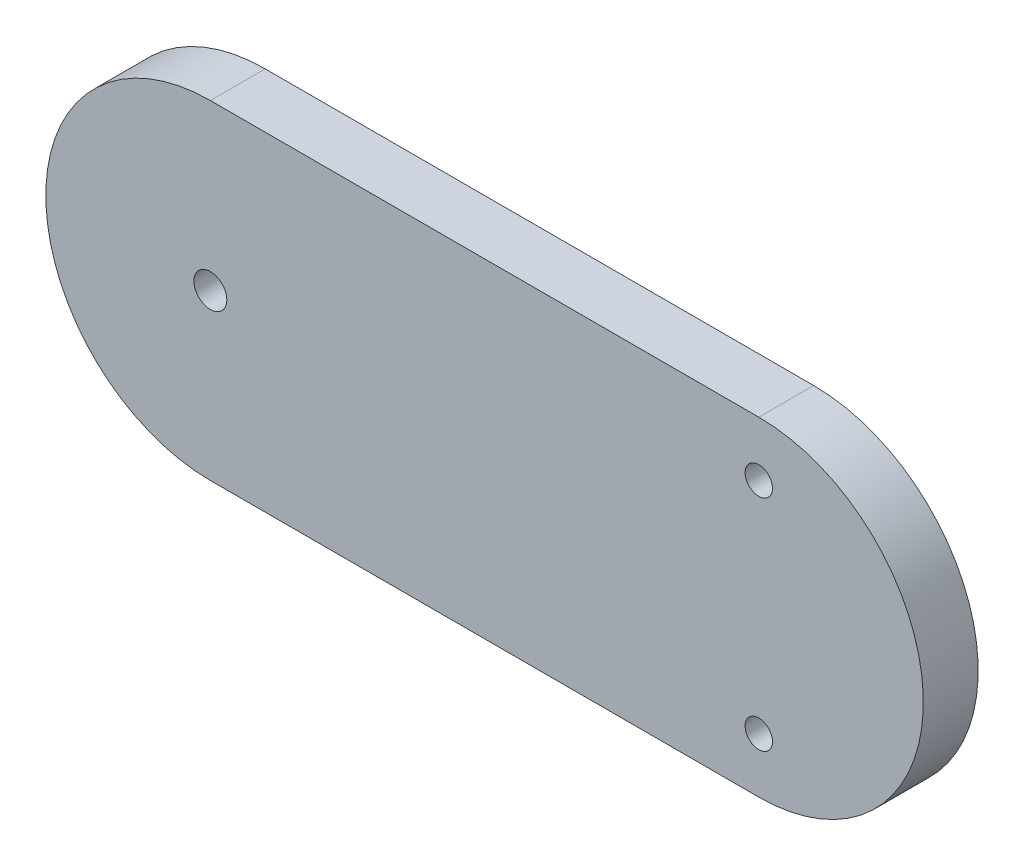
ISO-10303-21;
HEADER;
FILE_DESCRIPTION(('STEP AP214'),'2;1');
FILE_NAME('part.step','',(''),(''),'','','');
FILE_SCHEMA(('AUTOMOTIVE_DESIGN { 1 0 10303 214 1 1 1 1 }'));
ENDSEC;
DATA;
#1=APPLICATION_CONTEXT('core data for automotive mechanical design processes');
#2=APPLICATION_PROTOCOL_DEFINITION('international standard','automotive_design',2000,#1);
#3=PRODUCT_CONTEXT('',#1,'mechanical');
#4=PRODUCT('Part','Part','',(#3));
#5=PRODUCT_RELATED_PRODUCT_CATEGORY('part','',(#4));
#6=PRODUCT_DEFINITION_FORMATION('','',#4);
#7=PRODUCT_DEFINITION_CONTEXT('part definition',#1,'design');
#8=PRODUCT_DEFINITION('design','',#6,#7);
#9=PRODUCT_DEFINITION_SHAPE('','',#8);
#10=(LENGTH_UNIT() NAMED_UNIT(*) SI_UNIT(.MILLI.,.METRE.));
#11=(NAMED_UNIT(*) PLANE_ANGLE_UNIT() SI_UNIT($,.RADIAN.));
#12=(NAMED_UNIT(*) SI_UNIT($,.STERADIAN.) SOLID_ANGLE_UNIT());
#13=UNCERTAINTY_MEASURE_WITH_UNIT(LENGTH_MEASURE(1.E-05),#10,'distance_accuracy_value','');
#14=(GEOMETRIC_REPRESENTATION_CONTEXT(3) GLOBAL_UNCERTAINTY_ASSIGNED_CONTEXT((#13)) GLOBAL_UNIT_ASSIGNED_CONTEXT((#10,
#11,#12)) REPRESENTATION_CONTEXT('',''));
#15=CARTESIAN_POINT('',(0.,0.,0.));
#16=DIRECTION('',(0.,0.,1.));
#17=DIRECTION('',(1.,0.,0.));
#18=AXIS2_PLACEMENT_3D('',#15,#16,#17);
#19=CARTESIAN_POINT('',(-21.2273246696161,0.,5.));
#20=DIRECTION('',(0.,0.,1.));
#21=DIRECTION('',(1.,0.,0.));
#22=AXIS2_PLACEMENT_3D('',#19,#20,#21);
#23=PLANE('',#22);
#24=CARTESIAN_POINT('',(28.7726753303839,10.,5.));
#25=DIRECTION('',(0.,0.,1.));
#26=DIRECTION('',(1.,0.,0.));
#27=AXIS2_PLACEMENT_3D('',#24,#25,#26);
#28=CIRCLE('',#27,1.25);
#29=CARTESIAN_POINT('',(30.0226753303839,10.,5.));
#30=VERTEX_POINT('',#29);
#31=EDGE_CURVE('E115',#30,#30,#28,.T.);
#32=ORIENTED_EDGE('',*,*,#31,.F.);
#33=EDGE_LOOP('',(#32));
#34=FACE_BOUND('',#33,.T.);
#35=CARTESIAN_POINT('',(-21.2273246696161,0.,5.));
#36=DIRECTION('',(0.,0.,1.));
#37=DIRECTION('',(1.,0.,0.));
#38=AXIS2_PLACEMENT_3D('',#35,#36,#37);
#39=CIRCLE('',#38,15.);
#40=CARTESIAN_POINT('',(-21.2273246696161,15.,5.));
#41=VERTEX_POINT('',#40);
#42=CARTESIAN_POINT('',(-21.2273246696161,-15.,5.));
#43=VERTEX_POINT('',#42);
#44=EDGE_CURVE('E85',#41,#43,#39,.T.);
#45=ORIENTED_EDGE('',*,*,#44,.T.);
#46=DIRECTION('',(1.,0.,0.));
#47=VECTOR('',#46,1.);
#48=CARTESIAN_POINT('',(-21.2273246696161,-15.,5.));
#49=LINE('',#48,#47);
#50=CARTESIAN_POINT('',(28.7726753303839,-15.,5.));
#51=VERTEX_POINT('',#50);
#52=EDGE_CURVE('E80',#43,#51,#49,.T.);
#53=ORIENTED_EDGE('',*,*,#52,.T.);
#54=CARTESIAN_POINT('',(28.7726753303839,0.,5.));
#55=DIRECTION('',(0.,0.,1.));
#56=DIRECTION('',(1.,0.,0.));
#57=AXIS2_PLACEMENT_3D('',#54,#55,#56);
#58=CIRCLE('',#57,15.);
#59=CARTESIAN_POINT('',(28.7726753303839,15.,5.));
#60=VERTEX_POINT('',#59);
#61=EDGE_CURVE('E83',#51,#60,#58,.T.);
#62=ORIENTED_EDGE('',*,*,#61,.T.);
#63=DIRECTION('',(-1.,0.,0.));
#64=VECTOR('',#63,1.);
#65=CARTESIAN_POINT('',(-21.2273246696161,15.,5.));
#66=LINE('',#65,#64);
#67=EDGE_CURVE('E50',#60,#41,#66,.T.);
#68=ORIENTED_EDGE('',*,*,#67,.T.);
#69=EDGE_LOOP('',(#45,#53,#62,#68));
#70=FACE_BOUND('',#69,.T.);
#71=CARTESIAN_POINT('',(28.7726753303839,-10.,5.));
#72=DIRECTION('',(0.,0.,1.));
#73=DIRECTION('',(1.,0.,0.));
#74=AXIS2_PLACEMENT_3D('',#71,#72,#73);
#75=CIRCLE('',#74,1.25);
#76=CARTESIAN_POINT('',(30.0226753303839,-10.,5.));
#77=VERTEX_POINT('',#76);
#78=EDGE_CURVE('E100',#77,#77,#75,.T.);
#79=ORIENTED_EDGE('',*,*,#78,.F.);
#80=EDGE_LOOP('',(#79));
#81=FACE_BOUND('',#80,.T.);
#82=CARTESIAN_POINT('',(-21.2273246696161,0.,5.));
#83=DIRECTION('',(0.,0.,1.));
#84=DIRECTION('',(1.,0.,0.));
#85=AXIS2_PLACEMENT_3D('',#82,#83,#84);
#86=CIRCLE('',#85,1.5);
#87=CARTESIAN_POINT('',(-19.7273246696161,0.,5.));
#88=VERTEX_POINT('',#87);
#89=EDGE_CURVE('E121',#88,#88,#86,.T.);
#90=ORIENTED_EDGE('',*,*,#89,.F.);
#91=EDGE_LOOP('',(#90));
#92=FACE_BOUND('',#91,.T.);
#93=ADVANCED_FACE('F33',(#34,#70,#81,#92),#23,.T.);
#94=CARTESIAN_POINT('',(-21.2273246696161,0.,0.));
#95=DIRECTION('',(0.,0.,1.));
#96=DIRECTION('',(1.,0.,0.));
#97=AXIS2_PLACEMENT_3D('',#94,#95,#96);
#98=PLANE('',#97);
#99=CARTESIAN_POINT('',(-21.2273246696161,0.,0.));
#100=DIRECTION('',(0.,0.,1.));
#101=DIRECTION('',(1.,0.,0.));
#102=AXIS2_PLACEMENT_3D('',#99,#100,#101);
#103=CIRCLE('',#102,15.);
#104=CARTESIAN_POINT('',(-21.2273246696161,15.,0.));
#105=VERTEX_POINT('',#104);
#106=CARTESIAN_POINT('',(-21.2273246696161,-15.,0.));
#107=VERTEX_POINT('',#106);
#108=EDGE_CURVE('E97',#105,#107,#103,.T.);
#109=ORIENTED_EDGE('',*,*,#108,.F.);
#110=DIRECTION('',(-1.,0.,0.));
#111=VECTOR('',#110,1.);
#112=CARTESIAN_POINT('',(-21.2273246696161,15.,0.));
#113=LINE('',#112,#111);
#114=CARTESIAN_POINT('',(28.7726753303839,15.,0.));
#115=VERTEX_POINT('',#114);
#116=EDGE_CURVE('E73',#115,#105,#113,.T.);
#117=ORIENTED_EDGE('',*,*,#116,.F.);
#118=CARTESIAN_POINT('',(28.7726753303839,0.,0.));
#119=DIRECTION('',(0.,0.,1.));
#120=DIRECTION('',(1.,0.,0.));
#121=AXIS2_PLACEMENT_3D('',#118,#119,#120);
#122=CIRCLE('',#121,15.);
#123=CARTESIAN_POINT('',(28.7726753303839,-15.,0.));
#124=VERTEX_POINT('',#123);
#125=EDGE_CURVE('E67',#124,#115,#122,.T.);
#126=ORIENTED_EDGE('',*,*,#125,.F.);
#127=DIRECTION('',(1.,0.,0.));
#128=VECTOR('',#127,1.);
#129=CARTESIAN_POINT('',(-21.2273246696161,-15.,0.));
#130=LINE('',#129,#128);
#131=EDGE_CURVE('E89',#107,#124,#130,.T.);
#132=ORIENTED_EDGE('',*,*,#131,.F.);
#133=EDGE_LOOP('',(#109,#117,#126,#132));
#134=FACE_BOUND('',#133,.T.);
#135=CARTESIAN_POINT('',(28.7726753303839,-10.,0.));
#136=DIRECTION('',(0.,0.,1.));
#137=DIRECTION('',(1.,0.,0.));
#138=AXIS2_PLACEMENT_3D('',#135,#136,#137);
#139=CIRCLE('',#138,1.25);
#140=CARTESIAN_POINT('',(30.0226753303839,-10.,0.));
#141=VERTEX_POINT('',#140);
#142=EDGE_CURVE('E112',#141,#141,#139,.T.);
#143=ORIENTED_EDGE('',*,*,#142,.T.);
#144=EDGE_LOOP('',(#143));
#145=FACE_BOUND('',#144,.T.);
#146=CARTESIAN_POINT('',(28.7726753303839,10.,0.));
#147=DIRECTION('',(0.,0.,1.));
#148=DIRECTION('',(1.,0.,0.));
#149=AXIS2_PLACEMENT_3D('',#146,#147,#148);
#150=CIRCLE('',#149,1.25);
#151=CARTESIAN_POINT('',(30.0226753303839,10.,0.));
#152=VERTEX_POINT('',#151);
#153=EDGE_CURVE('E118',#152,#152,#150,.T.);
#154=ORIENTED_EDGE('',*,*,#153,.T.);
#155=EDGE_LOOP('',(#154));
#156=FACE_BOUND('',#155,.T.);
#157=CARTESIAN_POINT('',(-21.2273246696161,0.,0.));
#158=DIRECTION('',(0.,0.,1.));
#159=DIRECTION('',(1.,0.,0.));
#160=AXIS2_PLACEMENT_3D('',#157,#158,#159);
#161=CIRCLE('',#160,1.5);
#162=CARTESIAN_POINT('',(-19.7273246696161,0.,0.));
#163=VERTEX_POINT('',#162);
#164=EDGE_CURVE('E124',#163,#163,#161,.T.);
#165=ORIENTED_EDGE('',*,*,#164,.T.);
#166=EDGE_LOOP('',(#165));
#167=FACE_BOUND('',#166,.T.);
#168=ADVANCED_FACE('F108',(#134,#145,#156,#167),#98,.F.);
#169=CARTESIAN_POINT('',(-21.2273246696161,0.,5.));
#170=DIRECTION('',(0.,0.,-1.));
#171=DIRECTION('',(-1.,0.,0.));
#172=AXIS2_PLACEMENT_3D('',#169,#170,#171);
#173=CYLINDRICAL_SURFACE('',#172,15.);
#174=ORIENTED_EDGE('',*,*,#108,.T.);
#175=DIRECTION('',(0.,0.,-1.));
#176=VECTOR('',#175,1.);
#177=CARTESIAN_POINT('',(-21.2273246696161,-15.,5.));
#178=LINE('',#177,#176);
#179=EDGE_CURVE('E11',#43,#107,#178,.T.);
#180=ORIENTED_EDGE('',*,*,#179,.F.);
#181=ORIENTED_EDGE('',*,*,#44,.F.);
#182=DIRECTION('',(0.,0.,-1.));
#183=VECTOR('',#182,1.);
#184=CARTESIAN_POINT('',(-21.2273246696161,15.,5.));
#185=LINE('',#184,#183);
#186=EDGE_CURVE('E93',#41,#105,#185,.T.);
#187=ORIENTED_EDGE('',*,*,#186,.T.);
#188=EDGE_LOOP('',(#174,#180,#181,#187));
#189=FACE_BOUND('',#188,.T.);
#190=ADVANCED_FACE('F35',(#189),#173,.T.);
#191=CARTESIAN_POINT('',(-21.2273246696161,-15.,5.));
#192=DIRECTION('',(0.,1.,0.));
#193=DIRECTION('',(0.,0.,1.));
#194=AXIS2_PLACEMENT_3D('',#191,#192,#193);
#195=PLANE('',#194);
#196=ORIENTED_EDGE('',*,*,#131,.T.);
#197=DIRECTION('',(0.,0.,-1.));
#198=VECTOR('',#197,1.);
#199=CARTESIAN_POINT('',(28.7726753303839,-15.,5.));
#200=LINE('',#199,#198);
#201=EDGE_CURVE('E42',#51,#124,#200,.T.);
#202=ORIENTED_EDGE('',*,*,#201,.F.);
#203=ORIENTED_EDGE('',*,*,#52,.F.);
#204=ORIENTED_EDGE('',*,*,#179,.T.);
#205=EDGE_LOOP('',(#196,#202,#203,#204));
#206=FACE_BOUND('',#205,.T.);
#207=ADVANCED_FACE('F88',(#206),#195,.F.);
#208=CARTESIAN_POINT('',(28.7726753303839,0.,5.));
#209=DIRECTION('',(0.,0.,-1.));
#210=DIRECTION('',(-1.,0.,0.));
#211=AXIS2_PLACEMENT_3D('',#208,#209,#210);
#212=CYLINDRICAL_SURFACE('',#211,15.);
#213=ORIENTED_EDGE('',*,*,#125,.T.);
#214=DIRECTION('',(0.,0.,-1.));
#215=VECTOR('',#214,1.);
#216=CARTESIAN_POINT('',(28.7726753303839,15.,5.));
#217=LINE('',#216,#215);
#218=EDGE_CURVE('E90',#60,#115,#217,.T.);
#219=ORIENTED_EDGE('',*,*,#218,.F.);
#220=ORIENTED_EDGE('',*,*,#61,.F.);
#221=ORIENTED_EDGE('',*,*,#201,.T.);
#222=EDGE_LOOP('',(#213,#219,#220,#221));
#223=FACE_BOUND('',#222,.T.);
#224=ADVANCED_FACE('F91',(#223),#212,.T.);
#225=CARTESIAN_POINT('',(-21.2273246696161,15.,5.));
#226=DIRECTION('',(0.,-1.,0.));
#227=DIRECTION('',(0.,0.,-1.));
#228=AXIS2_PLACEMENT_3D('',#225,#226,#227);
#229=PLANE('',#228);
#230=ORIENTED_EDGE('',*,*,#116,.T.);
#231=ORIENTED_EDGE('',*,*,#186,.F.);
#232=ORIENTED_EDGE('',*,*,#67,.F.);
#233=ORIENTED_EDGE('',*,*,#218,.T.);
#234=EDGE_LOOP('',(#230,#231,#232,#233));
#235=FACE_BOUND('',#234,.T.);
#236=ADVANCED_FACE('F105',(#235),#229,.F.);
#237=CARTESIAN_POINT('',(28.7726753303839,-10.,5.));
#238=DIRECTION('',(0.,0.,-1.));
#239=DIRECTION('',(-1.,0.,0.));
#240=AXIS2_PLACEMENT_3D('',#237,#238,#239);
#241=CYLINDRICAL_SURFACE('',#240,1.25);
#242=ORIENTED_EDGE('',*,*,#78,.T.);
#243=EDGE_LOOP('',(#242));
#244=FACE_BOUND('',#243,.T.);
#245=ORIENTED_EDGE('',*,*,#142,.F.);
#246=EDGE_LOOP('',(#245));
#247=FACE_BOUND('',#246,.T.);
#248=ADVANCED_FACE('F142',(#244,#247),#241,.F.);
#249=CARTESIAN_POINT('',(28.7726753303839,10.,5.));
#250=DIRECTION('',(0.,0.,-1.));
#251=DIRECTION('',(-1.,0.,0.));
#252=AXIS2_PLACEMENT_3D('',#249,#250,#251);
#253=CYLINDRICAL_SURFACE('',#252,1.25);
#254=ORIENTED_EDGE('',*,*,#31,.T.);
#255=EDGE_LOOP('',(#254));
#256=FACE_BOUND('',#255,.T.);
#257=ORIENTED_EDGE('',*,*,#153,.F.);
#258=EDGE_LOOP('',(#257));
#259=FACE_BOUND('',#258,.T.);
#260=ADVANCED_FACE('F188',(#256,#259),#253,.F.);
#261=CARTESIAN_POINT('',(-21.2273246696161,0.,5.));
#262=DIRECTION('',(0.,0.,-1.));
#263=DIRECTION('',(-1.,0.,0.));
#264=AXIS2_PLACEMENT_3D('',#261,#262,#263);
#265=CYLINDRICAL_SURFACE('',#264,1.5);
#266=ORIENTED_EDGE('',*,*,#89,.T.);
#267=EDGE_LOOP('',(#266));
#268=FACE_BOUND('',#267,.T.);
#269=ORIENTED_EDGE('',*,*,#164,.F.);
#270=EDGE_LOOP('',(#269));
#271=FACE_BOUND('',#270,.T.);
#272=ADVANCED_FACE('F130',(#268,#271),#265,.F.);
#273=CLOSED_SHELL('',(#93,#168,#190,#207,#224,#236,#248,#260,#272));
#274=MANIFOLD_SOLID_BREP('B2',#273);
#275=ADVANCED_BREP_SHAPE_REPRESENTATION('',(#18,#274),#14);
#276=SHAPE_DEFINITION_REPRESENTATION(#9,#275);
ENDSEC;
END-ISO-10303-21;
